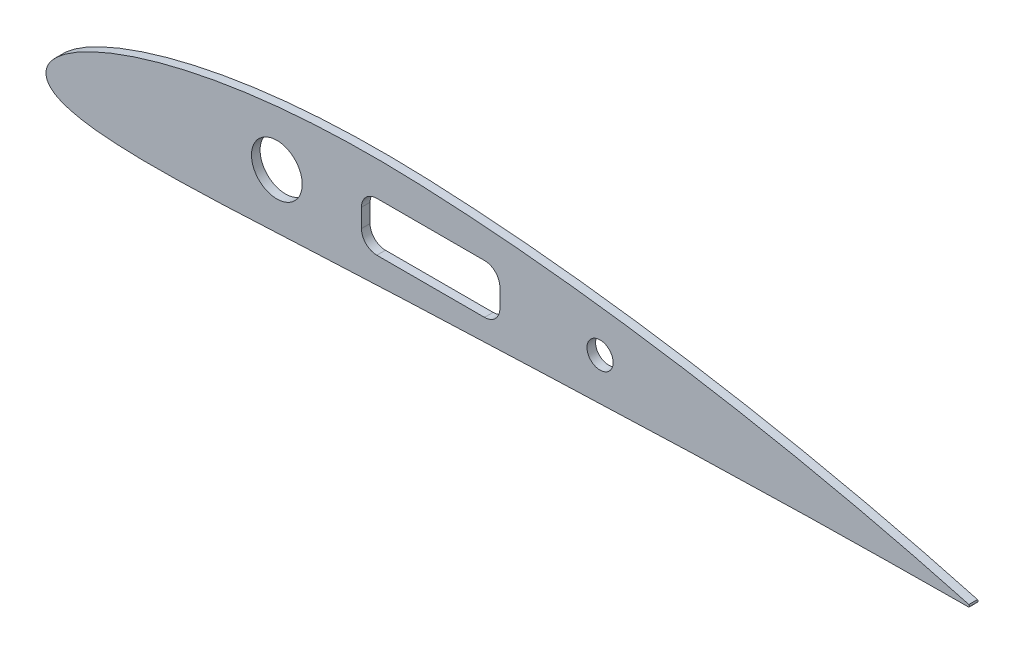
ISO-10303-21;
HEADER;
FILE_DESCRIPTION(('STEP AP214'),'2;1');
FILE_NAME('part.step','',(''),(''),'','','');
FILE_SCHEMA(('AUTOMOTIVE_DESIGN { 1 0 10303 214 1 1 1 1 }'));
ENDSEC;
DATA;
#1=APPLICATION_CONTEXT('core data for automotive mechanical design processes');
#2=APPLICATION_PROTOCOL_DEFINITION('international standard','automotive_design',2000,#1);
#3=PRODUCT_CONTEXT('',#1,'mechanical');
#4=PRODUCT('Part','Part','',(#3));
#5=PRODUCT_RELATED_PRODUCT_CATEGORY('part','',(#4));
#6=PRODUCT_DEFINITION_FORMATION('','',#4);
#7=PRODUCT_DEFINITION_CONTEXT('part definition',#1,'design');
#8=PRODUCT_DEFINITION('design','',#6,#7);
#9=PRODUCT_DEFINITION_SHAPE('','',#8);
#10=(LENGTH_UNIT() NAMED_UNIT(*) SI_UNIT(.MILLI.,.METRE.));
#11=(NAMED_UNIT(*) PLANE_ANGLE_UNIT() SI_UNIT($,.RADIAN.));
#12=(NAMED_UNIT(*) SI_UNIT($,.STERADIAN.) SOLID_ANGLE_UNIT());
#13=UNCERTAINTY_MEASURE_WITH_UNIT(LENGTH_MEASURE(1.E-05),#10,'distance_accuracy_value','');
#14=(GEOMETRIC_REPRESENTATION_CONTEXT(3) GLOBAL_UNCERTAINTY_ASSIGNED_CONTEXT((#13)) GLOBAL_UNIT_ASSIGNED_CONTEXT((#10,
#11,#12)) REPRESENTATION_CONTEXT('',''));
#15=CARTESIAN_POINT('',(0.,0.,0.));
#16=DIRECTION('',(0.,0.,1.));
#17=DIRECTION('',(1.,0.,0.));
#18=AXIS2_PLACEMENT_3D('',#15,#16,#17);
#19=CARTESIAN_POINT('',(148.430746079089,-4.2796086798326,1.4));
#20=DIRECTION('',(0.,0.,-1.));
#21=DIRECTION('',(-1.,0.,0.));
#22=AXIS2_PLACEMENT_3D('',#19,#20,#21);
#23=PLANE('',#22);
#24=CARTESIAN_POINT('',(180.094939635946,10.6624450341782,1.4));
#25=DIRECTION('',(0.,0.,1.));
#26=DIRECTION('',(1.,0.,0.));
#27=AXIS2_PLACEMENT_3D('',#24,#25,#26);
#28=CIRCLE('',#27,4.25000000000001);
#29=CARTESIAN_POINT('',(184.344939635946,10.6624450341782,1.4));
#30=VERTEX_POINT('',#29);
#31=EDGE_CURVE('E194',#30,#30,#28,.T.);
#32=ORIENTED_EDGE('',*,*,#31,.F.);
#33=EDGE_LOOP('',(#32));
#34=FACE_BOUND('',#33,.T.);
#35=CARTESIAN_POINT('',(75.0410106816443,10.3155765877524,1.4));
#36=DIRECTION('',(0.,0.,1.));
#37=DIRECTION('',(1.,0.,0.));
#38=AXIS2_PLACEMENT_3D('',#35,#36,#37);
#39=CIRCLE('',#38,8.25000000000637);
#40=CARTESIAN_POINT('',(83.2910106816506,10.3155765877524,1.4));
#41=VERTEX_POINT('',#40);
#42=EDGE_CURVE('E200',#41,#41,#39,.T.);
#43=ORIENTED_EDGE('',*,*,#42,.F.);
#44=EDGE_LOOP('',(#43));
#45=FACE_BOUND('',#44,.T.);
#46=CARTESIAN_POINT('',(0.00249,-0.14724,1.4));
#47=CARTESIAN_POINT('',(0.0288641688854633,-0.445513844414603,1.4));
#48=CARTESIAN_POINT('',(0.0833057800904263,-1.06121129978275,1.4));
#49=CARTESIAN_POINT('',(0.422671390377827,-1.96663822729653,1.4));
#50=CARTESIAN_POINT('',(0.976281814573221,-2.83807289649458,1.4));
#51=CARTESIAN_POINT('',(1.75645978779488,-3.64713332484532,1.4));
#52=CARTESIAN_POINT('',(2.74907794082149,-4.3931984024834,1.4));
#53=CARTESIAN_POINT('',(3.96714374613249,-5.08293585867439,1.4));
#54=CARTESIAN_POINT('',(5.44229690863356,-5.72840886692502,1.4));
#55=CARTESIAN_POINT('',(7.2356982456091,-6.33863063415687,1.4));
#56=CARTESIAN_POINT('',(9.44277622720337,-6.91837999855022,1.4));
#57=CARTESIAN_POINT('',(12.2025981281143,-7.46605991636749,1.4));
#58=CARTESIAN_POINT('',(15.6905256540105,-7.96754247553604,1.4));
#59=CARTESIAN_POINT('',(20.0737384988992,-8.3915480858464,1.4));
#60=CARTESIAN_POINT('',(25.4279424931762,-8.69681417335037,1.4));
#61=CARTESIAN_POINT('',(31.6799813058299,-8.85196661878203,1.4));
#62=CARTESIAN_POINT('',(38.6368782746042,-8.85150829562618,1.4));
#63=CARTESIAN_POINT('',(46.0773681114888,-8.71372389572811,1.4));
#64=CARTESIAN_POINT('',(53.8291461214035,-8.46796962975638,1.4));
#65=CARTESIAN_POINT('',(61.7838517154262,-8.14374423824506,1.4));
#66=CARTESIAN_POINT('',(69.8771771185494,-7.76678950417677,1.4));
#67=CARTESIAN_POINT('',(78.0625135272191,-7.3594227174564,1.4));
#68=CARTESIAN_POINT('',(86.2929272510796,-6.94080621211282,1.4));
#69=CARTESIAN_POINT('',(94.52565069144,-6.52761654439103,1.4));
#70=CARTESIAN_POINT('',(102.732598331766,-6.1331415031146,1.4));
#71=CARTESIAN_POINT('',(110.918529107916,-5.76594399090627,1.4));
#72=CARTESIAN_POINT('',(119.106037428137,-5.43837798583262,1.4));
#73=CARTESIAN_POINT('',(127.316854085887,-5.13392960517217,1.4));
#74=CARTESIAN_POINT('',(135.563054016299,-4.80370791115035,1.4));
#75=CARTESIAN_POINT('',(143.837285105454,-4.46781142112651,1.4));
#76=CARTESIAN_POINT('',(152.128632568186,-4.12808075570405,1.4));
#77=CARTESIAN_POINT('',(160.417875855798,-3.79043472053915,1.4));
#78=CARTESIAN_POINT('',(168.698244488521,-3.4588568645267,1.4));
#79=CARTESIAN_POINT('',(176.966416513952,-3.1367075499438,1.4));
#80=CARTESIAN_POINT('',(185.223122892775,-2.82675169781747,1.4));
#81=CARTESIAN_POINT('',(193.47005296097,-2.53124390528859,1.4));
#82=CARTESIAN_POINT('',(201.709043695345,-2.25196088915263,1.4));
#83=CARTESIAN_POINT('',(209.941894226343,-1.99037172481699,1.4));
#84=CARTESIAN_POINT('',(218.170315158738,-1.74765374764245,1.4));
#85=CARTESIAN_POINT('',(226.395881354852,-1.52446005264915,1.4));
#86=CARTESIAN_POINT('',(234.619974201183,-1.32133546096737,1.4));
#87=CARTESIAN_POINT('',(242.843439472485,-1.13834062649556,1.4));
#88=CARTESIAN_POINT('',(253.799028348439,-0.921290824137908,1.4));
#89=CARTESIAN_POINT('',(264.723718399079,-0.743927690678651,1.4));
#90=CARTESIAN_POINT('',(275.541156206627,-0.603511415990534,1.4));
#91=CARTESIAN_POINT('',(283.304824624749,-0.517817030046947,1.4));
#92=CARTESIAN_POINT('',(290.376932295173,-0.451824553738442,1.4));
#93=CARTESIAN_POINT('',(295.870764012939,-0.407443063098533,1.4));
#94=CARTESIAN_POINT('',(298.944589157433,-0.385525490945527,1.4));
#95=CARTESIAN_POINT('',(300.,-0.378,1.4));
#96=B_SPLINE_CURVE_WITH_KNOTS('',3,(#46,#47,#48,#49,#50,#51,#52,#53,#54,#55,#56,#57,#58,#59,#60,
#61,#62,#63,#64,#65,#66,#67,#68,#69,#70,#71,#72,#73,#74,#75,#76,#77,#78,#79,#80,#81,#82,#83,#84,
#85,#86,#87,#88,#89,#90,#91,#92,#93,#94,#95),.UNSPECIFIED.,.F.,.F.,(4,1,1,1,1,1,1,1,1,1,1,1,1,1,
1,1,1,1,1,1,1,1,1,1,1,1,1,1,1,1,1,1,1,1,1,1,1,1,1,1,1,1,1,1,1,1,1,4),(0.,0.00295155454187813,
0.00609260468138345,0.00945089974770261,0.0131050353483775,0.0171458323785718,
0.0216960994114763,0.0269215768167943,0.0330527867072691,0.0404178803055317,0.049480061989254,
0.0608721953266465,0.0752631118751332,0.0930303587905709,0.113913710781101,0.137122622864392,
0.161846787507909,0.187529050722836,0.213844767657257,0.240604039549654,0.267679501362261,
0.294919063837578,0.322129351782385,0.34922488677745,0.37620063639372,0.40319053291318,
0.430285050730301,0.457482608831412,0.484832061499181,0.512206010416882,0.53957427714013,
0.566902093806344,0.594185888539568,0.621429901327116,0.648639753003801,0.675821648028279,
0.70298156459292,0.730124951930402,0.757257323678464,0.784383538796943,0.811507209416005,
0.838628701004968,0.892783780904612,0.919594556327485,0.945650049930795,0.969591154880402,
0.989558994627054,1.),.UNSPECIFIED.);
#97=CARTESIAN_POINT('',(0.00249,-0.14724,1.4));
#98=VERTEX_POINT('',#97);
#99=CARTESIAN_POINT('',(300.,-0.378,1.4));
#100=VERTEX_POINT('',#99);
#101=EDGE_CURVE('E205',#98,#100,#96,.T.);
#102=ORIENTED_EDGE('',*,*,#101,.T.);
#103=CARTESIAN_POINT('',(299.622,0.,1.4));
#104=DIRECTION('',(0.,0.,1.));
#105=DIRECTION('',(-1.,0.,0.));
#106=AXIS2_PLACEMENT_3D('',#103,#104,#105);
#107=CIRCLE('',#106,0.534572726577062);
#108=CARTESIAN_POINT('',(300.,0.378,1.4));
#109=VERTEX_POINT('',#108);
#110=EDGE_CURVE('E211',#100,#109,#107,.T.);
#111=ORIENTED_EDGE('',*,*,#110,.T.);
#112=CARTESIAN_POINT('',(300.,0.378,1.4));
#113=CARTESIAN_POINT('',(298.98680128776,0.654023781403535,1.4));
#114=CARTESIAN_POINT('',(296.064210837156,1.45021949101575,1.4));
#115=CARTESIAN_POINT('',(290.869598499995,2.83000686313952,1.4));
#116=CARTESIAN_POINT('',(284.21971344516,4.54515043735707,1.4));
#117=CARTESIAN_POINT('',(276.935901935239,6.35761060470515,1.4));
#118=CARTESIAN_POINT('',(269.347101536954,8.17543923315356,1.4));
#119=CARTESIAN_POINT('',(261.636652194795,9.9499327589503,1.4));
#120=CARTESIAN_POINT('',(253.874886053528,11.663682067936,1.4));
#121=CARTESIAN_POINT('',(246.086893810767,13.310849918933,1.4));
#122=CARTESIAN_POINT('',(238.28156509519,14.8894208716766,1.4));
#123=CARTESIAN_POINT('',(230.462843896224,16.3983575086196,1.4));
#124=CARTESIAN_POINT('',(222.633143967381,17.8369119637227,1.4));
#125=CARTESIAN_POINT('',(214.794406789338,19.2040857344674,1.4));
#126=CARTESIAN_POINT('',(206.948477689533,20.498865738249,1.4));
#127=CARTESIAN_POINT('',(199.097180513816,21.7197934093402,1.4));
#128=CARTESIAN_POINT('',(191.242416874809,22.8654021777622,1.4));
#129=CARTESIAN_POINT('',(183.386166153563,23.9338627233875,1.4));
#130=CARTESIAN_POINT('',(175.530527281634,24.923138619396,1.4));
#131=CARTESIAN_POINT('',(167.677631749552,25.8308113359842,1.4));
#132=CARTESIAN_POINT('',(159.83020407637,26.6544050986667,1.4));
#133=CARTESIAN_POINT('',(151.990419631337,27.3908657144166,1.4));
#134=CARTESIAN_POINT('',(144.164125101971,28.0367679193056,1.4));
#135=CARTESIAN_POINT('',(136.354280568601,28.5896127888858,1.4));
#136=CARTESIAN_POINT('',(128.583278444944,29.0402911124387,1.4));
#137=CARTESIAN_POINT('',(120.889314831539,29.3980794120577,1.4));
#138=CARTESIAN_POINT('',(113.294103257856,29.623979722126,1.4));
#139=CARTESIAN_POINT('',(105.787101591505,29.6881147803117,1.4));
#140=CARTESIAN_POINT('',(98.338851666315,29.5906189722756,1.4));
#141=CARTESIAN_POINT('',(90.9366247098875,29.3292165699766,1.4));
#142=CARTESIAN_POINT('',(83.5844315304011,28.8982617847225,1.4));
#143=CARTESIAN_POINT('',(76.290492602127,28.2936076331489,1.4));
#144=CARTESIAN_POINT('',(69.0662274611627,27.5099359897076,1.4));
#145=CARTESIAN_POINT('',(61.9269152260386,26.5428786259249,1.4));
#146=CARTESIAN_POINT('',(54.8932803737344,25.387877318499,1.4));
#147=CARTESIAN_POINT('',(47.9950291130081,24.0424456674072,1.4));
#148=CARTESIAN_POINT('',(41.2775038108488,22.5075794810016,1.4));
#149=CARTESIAN_POINT('',(34.8124585242293,20.7931387290732,1.4));
#150=CARTESIAN_POINT('',(28.7109580899014,18.9262379057851,1.4));
#151=CARTESIAN_POINT('',(23.1248146078509,16.961123320747,1.4));
#152=CARTESIAN_POINT('',(18.2149180695505,14.9800025250558,1.4));
#153=CARTESIAN_POINT('',(14.0885709481161,13.0747331937673,1.4));
#154=CARTESIAN_POINT('',(10.7512462427716,11.315492838388,1.4));
#155=CARTESIAN_POINT('',(8.11306941612396,9.73032383929158,1.4));
#156=CARTESIAN_POINT('',(6.04045169768157,8.3095656657077,1.4));
#157=CARTESIAN_POINT('',(4.40603392011968,7.02507559718571,1.4));
#158=CARTESIAN_POINT('',(3.11052134783298,5.84556644236323,1.4));
#159=CARTESIAN_POINT('',(2.08581080220328,4.74311489195384,1.4));
#160=CARTESIAN_POINT('',(1.28384499577925,3.69713564801613,1.4));
#161=CARTESIAN_POINT('',(0.685974492458288,2.68994652273,1.4));
#162=CARTESIAN_POINT('',(0.258928678594649,1.71694247641125,1.4));
#163=CARTESIAN_POINT('',(0.122706697861263,1.0598900334139,1.4));
#164=CARTESIAN_POINT('',(0.05757,0.74571,1.4));
#165=B_SPLINE_CURVE_WITH_KNOTS('',3,(#112,#113,#114,#115,#116,#117,#118,#119,#120,#121,#122,
#123,#124,#125,#126,#127,#128,#129,#130,#131,#132,#133,#134,#135,#136,#137,#138,#139,#140,#141,
#142,#143,#144,#145,#146,#147,#148,#149,#150,#151,#152,#153,#154,#155,#156,#157,#158,#159,#160,
#161,#162,#163,#164),.UNSPECIFIED.,.F.,.F.,(4,1,1,1,1,1,1,1,1,1,1,1,1,1,1,1,1,1,1,1,1,1,1,1,1,1,
1,1,1,1,1,1,1,1,1,1,1,1,1,1,1,1,1,1,1,1,1,1,1,1,4),(0.,0.0101621996718152,0.029313053164405,
0.0520116049167947,0.0766194676467142,0.101948061207292,0.127526131749972,0.153184130655642,
0.178867887696566,0.204557902716051,0.230245711588722,0.255925967287604,0.281594302232909,
0.307246419826604,0.332878041533464,0.358484538095463,0.384061185999046,0.409602822472883,
0.435103874040523,0.460559416336008,0.485959195382529,0.511303069995141,0.53655151535457,
0.561723365940153,0.586628866723787,0.611085431247163,0.63525120042125,0.659272175841394,
0.683163753229342,0.706922144180534,0.730535909866309,0.753983199646257,0.777234690063445,
0.800246382303428,0.822950708941546,0.845237155368769,0.866915895838024,0.887662334604257,
0.906968280539555,0.924203157053238,0.938878974509372,0.95093161065299,0.960693484285195,
0.968646729467272,0.975232933115936,0.980794743901537,0.985583761312909,0.989781538836832,
0.99352131251264,0.996902112954681,1.),.UNSPECIFIED.);
#166=CARTESIAN_POINT('',(0.05757,0.74571,1.4));
#167=VERTEX_POINT('',#166);
#168=EDGE_CURVE('E217',#109,#167,#165,.T.);
#169=ORIENTED_EDGE('',*,*,#168,.T.);
#170=DIRECTION('',(-0.0769725523661737,-0.997033212176123,0.));
#171=VECTOR('',#170,1.);
#172=CARTESIAN_POINT('',(0.05757,0.74571,1.4));
#173=LINE('',#172,#171);
#174=CARTESIAN_POINT('',(0.,0.,1.4));
#175=VERTEX_POINT('',#174);
#176=EDGE_CURVE('E222',#167,#175,#173,.T.);
#177=ORIENTED_EDGE('',*,*,#176,.T.);
#178=DIRECTION('',(0.0169087477716238,-0.999857036905175,0.));
#179=VECTOR('',#178,1.);
#180=CARTESIAN_POINT('',(0.,0.,1.4));
#181=LINE('',#180,#179);
#182=EDGE_CURVE('E281',#175,#98,#181,.T.);
#183=ORIENTED_EDGE('',*,*,#182,.T.);
#184=EDGE_LOOP('',(#102,#111,#169,#177,#183));
#185=FACE_BOUND('',#184,.T.);
#186=CARTESIAN_POINT('',(142.541010681644,13.4806672463687,1.4));
#187=DIRECTION('',(0.,0.,1.));
#188=DIRECTION('',(-1.,0.,0.));
#189=AXIS2_PLACEMENT_3D('',#186,#187,#188);
#190=CIRCLE('',#189,5.);
#191=CARTESIAN_POINT('',(147.541010681644,13.4806672463687,1.4));
#192=VERTEX_POINT('',#191);
#193=CARTESIAN_POINT('',(142.541010681644,18.4806672463687,1.4));
#194=VERTEX_POINT('',#193);
#195=EDGE_CURVE('E129',#192,#194,#190,.T.);
#196=ORIENTED_EDGE('',*,*,#195,.F.);
#197=DIRECTION('',(0.,1.,0.));
#198=VECTOR('',#197,1.);
#199=CARTESIAN_POINT('',(147.541010681644,7.48066724636866,1.4));
#200=LINE('',#199,#198);
#201=CARTESIAN_POINT('',(147.541010681644,7.48066724636866,1.4));
#202=VERTEX_POINT('',#201);
#203=EDGE_CURVE('E162',#202,#192,#200,.T.);
#204=ORIENTED_EDGE('',*,*,#203,.F.);
#205=CARTESIAN_POINT('',(142.541010681644,7.48066724636866,1.4));
#206=DIRECTION('',(0.,0.,1.));
#207=DIRECTION('',(1.,0.,0.));
#208=AXIS2_PLACEMENT_3D('',#205,#206,#207);
#209=CIRCLE('',#208,5.);
#210=CARTESIAN_POINT('',(142.541010681644,2.48066724636866,1.4));
#211=VERTEX_POINT('',#210);
#212=EDGE_CURVE('E160',#211,#202,#209,.T.);
#213=ORIENTED_EDGE('',*,*,#212,.F.);
#214=DIRECTION('',(1.,0.,0.));
#215=VECTOR('',#214,1.);
#216=CARTESIAN_POINT('',(107.541010681644,2.48066724636866,1.4));
#217=LINE('',#216,#215);
#218=CARTESIAN_POINT('',(107.541010681644,2.48066724636865,1.4));
#219=VERTEX_POINT('',#218);
#220=EDGE_CURVE('E158',#219,#211,#217,.T.);
#221=ORIENTED_EDGE('',*,*,#220,.F.);
#222=CARTESIAN_POINT('',(107.541010681644,7.48066724636866,1.4));
#223=DIRECTION('',(0.,0.,1.));
#224=DIRECTION('',(-1.,0.,0.));
#225=AXIS2_PLACEMENT_3D('',#222,#223,#224);
#226=CIRCLE('',#225,5.);
#227=CARTESIAN_POINT('',(102.541010681644,7.48066724636866,1.4));
#228=VERTEX_POINT('',#227);
#229=EDGE_CURVE('E156',#228,#219,#226,.T.);
#230=ORIENTED_EDGE('',*,*,#229,.F.);
#231=DIRECTION('',(0.,-1.,0.));
#232=VECTOR('',#231,1.);
#233=CARTESIAN_POINT('',(102.541010681644,7.48066724636866,1.4));
#234=LINE('',#233,#232);
#235=CARTESIAN_POINT('',(102.541010681644,13.4806672463687,1.4));
#236=VERTEX_POINT('',#235);
#237=EDGE_CURVE('E152',#236,#228,#234,.T.);
#238=ORIENTED_EDGE('',*,*,#237,.F.);
#239=CARTESIAN_POINT('',(107.541010681644,13.4806672463687,1.4));
#240=DIRECTION('',(0.,0.,1.));
#241=DIRECTION('',(-1.,0.,0.));
#242=AXIS2_PLACEMENT_3D('',#239,#240,#241);
#243=CIRCLE('',#242,5.);
#244=CARTESIAN_POINT('',(107.541010681644,18.4806672463687,1.4));
#245=VERTEX_POINT('',#244);
#246=EDGE_CURVE('E150',#245,#236,#243,.T.);
#247=ORIENTED_EDGE('',*,*,#246,.F.);
#248=DIRECTION('',(-1.,0.,0.));
#249=VECTOR('',#248,1.);
#250=CARTESIAN_POINT('',(107.541010681644,18.4806672463687,1.4));
#251=LINE('',#250,#249);
#252=EDGE_CURVE('E137',#194,#245,#251,.T.);
#253=ORIENTED_EDGE('',*,*,#252,.F.);
#254=EDGE_LOOP('',(#196,#204,#213,#221,#230,#238,#247,#253));
#255=FACE_BOUND('',#254,.T.);
#256=ADVANCED_FACE('F33',(#34,#45,#185,#255),#23,.F.);
#257=CARTESIAN_POINT('',(148.430746079089,-4.2796086798326,-1.4));
#258=DIRECTION('',(0.,0.,-1.));
#259=DIRECTION('',(-1.,0.,0.));
#260=AXIS2_PLACEMENT_3D('',#257,#258,#259);
#261=PLANE('',#260);
#262=CARTESIAN_POINT('',(75.0410106816443,10.3155765877524,-1.4));
#263=DIRECTION('',(0.,0.,1.));
#264=DIRECTION('',(1.,0.,0.));
#265=AXIS2_PLACEMENT_3D('',#262,#263,#264);
#266=CIRCLE('',#265,8.25000000000637);
#267=CARTESIAN_POINT('',(83.2910106816506,10.3155765877524,-1.4));
#268=VERTEX_POINT('',#267);
#269=EDGE_CURVE('E197',#268,#268,#266,.T.);
#270=ORIENTED_EDGE('',*,*,#269,.T.);
#271=EDGE_LOOP('',(#270));
#272=FACE_BOUND('',#271,.T.);
#273=CARTESIAN_POINT('',(0.00249,-0.14724,-1.4));
#274=CARTESIAN_POINT('',(0.0288641688854633,-0.445513844414603,-1.4));
#275=CARTESIAN_POINT('',(0.0833057800904263,-1.06121129978275,-1.4));
#276=CARTESIAN_POINT('',(0.422671390377827,-1.96663822729653,-1.4));
#277=CARTESIAN_POINT('',(0.976281814573221,-2.83807289649458,-1.4));
#278=CARTESIAN_POINT('',(1.75645978779488,-3.64713332484532,-1.4));
#279=CARTESIAN_POINT('',(2.74907794082149,-4.3931984024834,-1.4));
#280=CARTESIAN_POINT('',(3.96714374613249,-5.08293585867439,-1.4));
#281=CARTESIAN_POINT('',(5.44229690863356,-5.72840886692502,-1.4));
#282=CARTESIAN_POINT('',(7.2356982456091,-6.33863063415687,-1.4));
#283=CARTESIAN_POINT('',(9.44277622720337,-6.91837999855022,-1.4));
#284=CARTESIAN_POINT('',(12.2025981281143,-7.46605991636749,-1.4));
#285=CARTESIAN_POINT('',(15.6905256540105,-7.96754247553604,-1.4));
#286=CARTESIAN_POINT('',(20.0737384988992,-8.3915480858464,-1.4));
#287=CARTESIAN_POINT('',(25.4279424931762,-8.69681417335037,-1.4));
#288=CARTESIAN_POINT('',(31.6799813058299,-8.85196661878203,-1.4));
#289=CARTESIAN_POINT('',(38.6368782746042,-8.85150829562618,-1.4));
#290=CARTESIAN_POINT('',(46.0773681114888,-8.71372389572811,-1.4));
#291=CARTESIAN_POINT('',(53.8291461214035,-8.46796962975638,-1.4));
#292=CARTESIAN_POINT('',(61.7838517154262,-8.14374423824506,-1.4));
#293=CARTESIAN_POINT('',(69.8771771185494,-7.76678950417677,-1.4));
#294=CARTESIAN_POINT('',(78.0625135272191,-7.3594227174564,-1.4));
#295=CARTESIAN_POINT('',(86.2929272510796,-6.94080621211282,-1.4));
#296=CARTESIAN_POINT('',(94.52565069144,-6.52761654439103,-1.4));
#297=CARTESIAN_POINT('',(102.732598331766,-6.1331415031146,-1.4));
#298=CARTESIAN_POINT('',(110.918529107916,-5.76594399090627,-1.4));
#299=CARTESIAN_POINT('',(119.106037428137,-5.43837798583262,-1.4));
#300=CARTESIAN_POINT('',(127.316854085887,-5.13392960517217,-1.4));
#301=CARTESIAN_POINT('',(135.563054016299,-4.80370791115035,-1.4));
#302=CARTESIAN_POINT('',(143.837285105454,-4.46781142112651,-1.4));
#303=CARTESIAN_POINT('',(152.128632568186,-4.12808075570405,-1.4));
#304=CARTESIAN_POINT('',(160.417875855798,-3.79043472053915,-1.4));
#305=CARTESIAN_POINT('',(168.698244488521,-3.4588568645267,-1.4));
#306=CARTESIAN_POINT('',(176.966416513952,-3.1367075499438,-1.4));
#307=CARTESIAN_POINT('',(185.223122892775,-2.82675169781747,-1.4));
#308=CARTESIAN_POINT('',(193.47005296097,-2.53124390528859,-1.4));
#309=CARTESIAN_POINT('',(201.709043695345,-2.25196088915263,-1.4));
#310=CARTESIAN_POINT('',(209.941894226343,-1.99037172481699,-1.4));
#311=CARTESIAN_POINT('',(218.170315158738,-1.74765374764245,-1.4));
#312=CARTESIAN_POINT('',(226.395881354852,-1.52446005264915,-1.4));
#313=CARTESIAN_POINT('',(234.619974201183,-1.32133546096737,-1.4));
#314=CARTESIAN_POINT('',(242.843439472485,-1.13834062649556,-1.4));
#315=CARTESIAN_POINT('',(253.799028348439,-0.921290824137908,-1.4));
#316=CARTESIAN_POINT('',(264.723718399079,-0.743927690678651,-1.4));
#317=CARTESIAN_POINT('',(275.541156206627,-0.603511415990534,-1.4));
#318=CARTESIAN_POINT('',(283.304824624749,-0.517817030046947,-1.4));
#319=CARTESIAN_POINT('',(290.376932295173,-0.451824553738442,-1.4));
#320=CARTESIAN_POINT('',(295.870764012939,-0.407443063098533,-1.4));
#321=CARTESIAN_POINT('',(298.944589157433,-0.385525490945527,-1.4));
#322=CARTESIAN_POINT('',(300.,-0.378,-1.4));
#323=B_SPLINE_CURVE_WITH_KNOTS('',3,(#273,#274,#275,#276,#277,#278,#279,#280,#281,#282,#283,
#284,#285,#286,#287,#288,#289,#290,#291,#292,#293,#294,#295,#296,#297,#298,#299,#300,#301,#302,
#303,#304,#305,#306,#307,#308,#309,#310,#311,#312,#313,#314,#315,#316,#317,#318,#319,#320,#321,
#322),.UNSPECIFIED.,.F.,.F.,(4,1,1,1,1,1,1,1,1,1,1,1,1,1,1,1,1,1,1,1,1,1,1,1,1,1,1,1,1,1,1,1,1,
1,1,1,1,1,1,1,1,1,1,1,1,1,1,4),(0.,0.00295155454187813,0.00609260468138345,0.00945089974770261,
0.0131050353483775,0.0171458323785718,0.0216960994114763,0.0269215768167943,0.0330527867072691,
0.0404178803055317,0.049480061989254,0.0608721953266465,0.0752631118751332,0.0930303587905709,
0.113913710781101,0.137122622864392,0.161846787507909,0.187529050722836,0.213844767657257,
0.240604039549654,0.267679501362261,0.294919063837578,0.322129351782385,0.34922488677745,
0.37620063639372,0.40319053291318,0.430285050730301,0.457482608831412,0.484832061499181,
0.512206010416882,0.53957427714013,0.566902093806344,0.594185888539568,0.621429901327116,
0.648639753003801,0.675821648028279,0.70298156459292,0.730124951930402,0.757257323678464,
0.784383538796943,0.811507209416005,0.838628701004968,0.892783780904612,0.919594556327485,
0.945650049930795,0.969591154880402,0.989558994627054,1.),.UNSPECIFIED.);
#324=CARTESIAN_POINT('',(0.00249,-0.14724,-1.4));
#325=VERTEX_POINT('',#324);
#326=CARTESIAN_POINT('',(300.,-0.378,-1.4));
#327=VERTEX_POINT('',#326);
#328=EDGE_CURVE('E203',#325,#327,#323,.T.);
#329=ORIENTED_EDGE('',*,*,#328,.F.);
#330=DIRECTION('',(0.0169087477716238,-0.999857036905175,0.));
#331=VECTOR('',#330,1.);
#332=CARTESIAN_POINT('',(0.,0.,-1.4));
#333=LINE('',#332,#331);
#334=CARTESIAN_POINT('',(0.,0.,-1.4));
#335=VERTEX_POINT('',#334);
#336=EDGE_CURVE('E212',#335,#325,#333,.T.);
#337=ORIENTED_EDGE('',*,*,#336,.F.);
#338=DIRECTION('',(-0.0769725523661737,-0.997033212176123,0.));
#339=VECTOR('',#338,1.);
#340=CARTESIAN_POINT('',(0.05757,0.74571,-1.4));
#341=LINE('',#340,#339);
#342=CARTESIAN_POINT('',(0.05757,0.74571,-1.4));
#343=VERTEX_POINT('',#342);
#344=EDGE_CURVE('E277',#343,#335,#341,.T.);
#345=ORIENTED_EDGE('',*,*,#344,.F.);
#346=CARTESIAN_POINT('',(300.,0.378,-1.4));
#347=CARTESIAN_POINT('',(298.98680128776,0.654023781403535,-1.4));
#348=CARTESIAN_POINT('',(296.064210837156,1.45021949101575,-1.4));
#349=CARTESIAN_POINT('',(290.869598499995,2.83000686313952,-1.4));
#350=CARTESIAN_POINT('',(284.21971344516,4.54515043735707,-1.4));
#351=CARTESIAN_POINT('',(276.935901935239,6.35761060470515,-1.4));
#352=CARTESIAN_POINT('',(269.347101536954,8.17543923315356,-1.4));
#353=CARTESIAN_POINT('',(261.636652194795,9.9499327589503,-1.4));
#354=CARTESIAN_POINT('',(253.874886053528,11.663682067936,-1.4));
#355=CARTESIAN_POINT('',(246.086893810767,13.310849918933,-1.4));
#356=CARTESIAN_POINT('',(238.28156509519,14.8894208716766,-1.4));
#357=CARTESIAN_POINT('',(230.462843896224,16.3983575086196,-1.4));
#358=CARTESIAN_POINT('',(222.633143967381,17.8369119637227,-1.4));
#359=CARTESIAN_POINT('',(214.794406789338,19.2040857344674,-1.4));
#360=CARTESIAN_POINT('',(206.948477689533,20.498865738249,-1.4));
#361=CARTESIAN_POINT('',(199.097180513816,21.7197934093402,-1.4));
#362=CARTESIAN_POINT('',(191.242416874809,22.8654021777622,-1.4));
#363=CARTESIAN_POINT('',(183.386166153563,23.9338627233875,-1.4));
#364=CARTESIAN_POINT('',(175.530527281634,24.923138619396,-1.4));
#365=CARTESIAN_POINT('',(167.677631749552,25.8308113359842,-1.4));
#366=CARTESIAN_POINT('',(159.83020407637,26.6544050986667,-1.4));
#367=CARTESIAN_POINT('',(151.990419631337,27.3908657144166,-1.4));
#368=CARTESIAN_POINT('',(144.164125101971,28.0367679193056,-1.4));
#369=CARTESIAN_POINT('',(136.354280568601,28.5896127888858,-1.4));
#370=CARTESIAN_POINT('',(128.583278444944,29.0402911124387,-1.4));
#371=CARTESIAN_POINT('',(120.889314831539,29.3980794120577,-1.4));
#372=CARTESIAN_POINT('',(113.294103257856,29.623979722126,-1.4));
#373=CARTESIAN_POINT('',(105.787101591505,29.6881147803117,-1.4));
#374=CARTESIAN_POINT('',(98.338851666315,29.5906189722756,-1.4));
#375=CARTESIAN_POINT('',(90.9366247098875,29.3292165699766,-1.4));
#376=CARTESIAN_POINT('',(83.5844315304011,28.8982617847225,-1.4));
#377=CARTESIAN_POINT('',(76.290492602127,28.2936076331489,-1.4));
#378=CARTESIAN_POINT('',(69.0662274611627,27.5099359897076,-1.4));
#379=CARTESIAN_POINT('',(61.9269152260386,26.5428786259249,-1.4));
#380=CARTESIAN_POINT('',(54.8932803737344,25.387877318499,-1.4));
#381=CARTESIAN_POINT('',(47.9950291130081,24.0424456674072,-1.4));
#382=CARTESIAN_POINT('',(41.2775038108488,22.5075794810016,-1.4));
#383=CARTESIAN_POINT('',(34.8124585242293,20.7931387290732,-1.4));
#384=CARTESIAN_POINT('',(28.7109580899014,18.9262379057851,-1.4));
#385=CARTESIAN_POINT('',(23.1248146078509,16.961123320747,-1.4));
#386=CARTESIAN_POINT('',(18.2149180695505,14.9800025250558,-1.4));
#387=CARTESIAN_POINT('',(14.0885709481161,13.0747331937673,-1.4));
#388=CARTESIAN_POINT('',(10.7512462427716,11.315492838388,-1.4));
#389=CARTESIAN_POINT('',(8.11306941612396,9.73032383929158,-1.4));
#390=CARTESIAN_POINT('',(6.04045169768157,8.3095656657077,-1.4));
#391=CARTESIAN_POINT('',(4.40603392011968,7.02507559718571,-1.4));
#392=CARTESIAN_POINT('',(3.11052134783298,5.84556644236323,-1.4));
#393=CARTESIAN_POINT('',(2.08581080220328,4.74311489195384,-1.4));
#394=CARTESIAN_POINT('',(1.28384499577925,3.69713564801613,-1.4));
#395=CARTESIAN_POINT('',(0.685974492458288,2.68994652273,-1.4));
#396=CARTESIAN_POINT('',(0.258928678594649,1.71694247641125,-1.4));
#397=CARTESIAN_POINT('',(0.122706697861263,1.0598900334139,-1.4));
#398=CARTESIAN_POINT('',(0.05757,0.74571,-1.4));
#399=B_SPLINE_CURVE_WITH_KNOTS('',3,(#346,#347,#348,#349,#350,#351,#352,#353,#354,#355,#356,
#357,#358,#359,#360,#361,#362,#363,#364,#365,#366,#367,#368,#369,#370,#371,#372,#373,#374,#375,
#376,#377,#378,#379,#380,#381,#382,#383,#384,#385,#386,#387,#388,#389,#390,#391,#392,#393,#394,
#395,#396,#397,#398),.UNSPECIFIED.,.F.,.F.,(4,1,1,1,1,1,1,1,1,1,1,1,1,1,1,1,1,1,1,1,1,1,1,1,1,1,
1,1,1,1,1,1,1,1,1,1,1,1,1,1,1,1,1,1,1,1,1,1,1,1,4),(0.,0.0101621996718152,0.029313053164405,
0.0520116049167947,0.0766194676467142,0.101948061207292,0.127526131749972,0.153184130655642,
0.178867887696566,0.204557902716051,0.230245711588722,0.255925967287604,0.281594302232909,
0.307246419826604,0.332878041533464,0.358484538095463,0.384061185999046,0.409602822472883,
0.435103874040523,0.460559416336008,0.485959195382529,0.511303069995141,0.53655151535457,
0.561723365940153,0.586628866723787,0.611085431247163,0.63525120042125,0.659272175841394,
0.683163753229342,0.706922144180534,0.730535909866309,0.753983199646257,0.777234690063445,
0.800246382303428,0.822950708941546,0.845237155368769,0.866915895838024,0.887662334604257,
0.906968280539555,0.924203157053238,0.938878974509372,0.95093161065299,0.960693484285195,
0.968646729467272,0.975232933115936,0.980794743901537,0.985583761312909,0.989781538836832,
0.99352131251264,0.996902112954681,1.),.UNSPECIFIED.);
#400=CARTESIAN_POINT('',(300.,0.378,-1.4));
#401=VERTEX_POINT('',#400);
#402=EDGE_CURVE('E287',#401,#343,#399,.T.);
#403=ORIENTED_EDGE('',*,*,#402,.F.);
#404=CARTESIAN_POINT('',(299.622,0.,-1.4));
#405=DIRECTION('',(0.,0.,1.));
#406=DIRECTION('',(-1.,0.,0.));
#407=AXIS2_PLACEMENT_3D('',#404,#405,#406);
#408=CIRCLE('',#407,0.534572726577062);
#409=EDGE_CURVE('E285',#327,#401,#408,.T.);
#410=ORIENTED_EDGE('',*,*,#409,.F.);
#411=EDGE_LOOP('',(#329,#337,#345,#403,#410));
#412=FACE_BOUND('',#411,.T.);
#413=CARTESIAN_POINT('',(180.094939635946,10.6624450341782,-1.4));
#414=DIRECTION('',(0.,0.,1.));
#415=DIRECTION('',(1.,0.,0.));
#416=AXIS2_PLACEMENT_3D('',#413,#414,#415);
#417=CIRCLE('',#416,4.25000000000001);
#418=CARTESIAN_POINT('',(184.344939635946,10.6624450341782,-1.4));
#419=VERTEX_POINT('',#418);
#420=EDGE_CURVE('E145',#419,#419,#417,.T.);
#421=ORIENTED_EDGE('',*,*,#420,.T.);
#422=EDGE_LOOP('',(#421));
#423=FACE_BOUND('',#422,.T.);
#424=DIRECTION('',(0.,1.,0.));
#425=VECTOR('',#424,1.);
#426=CARTESIAN_POINT('',(147.541010681644,7.48066724636866,-1.4));
#427=LINE('',#426,#425);
#428=CARTESIAN_POINT('',(147.541010681644,7.48066724636866,-1.4));
#429=VERTEX_POINT('',#428);
#430=CARTESIAN_POINT('',(147.541010681644,13.4806672463687,-1.4));
#431=VERTEX_POINT('',#430);
#432=EDGE_CURVE('E138',#429,#431,#427,.T.);
#433=ORIENTED_EDGE('',*,*,#432,.T.);
#434=CARTESIAN_POINT('',(142.541010681644,13.4806672463687,-1.4));
#435=DIRECTION('',(0.,0.,1.));
#436=DIRECTION('',(-1.,0.,0.));
#437=AXIS2_PLACEMENT_3D('',#434,#435,#436);
#438=CIRCLE('',#437,5.);
#439=CARTESIAN_POINT('',(142.541010681644,18.4806672463687,-1.4));
#440=VERTEX_POINT('',#439);
#441=EDGE_CURVE('E57',#431,#440,#438,.T.);
#442=ORIENTED_EDGE('',*,*,#441,.T.);
#443=DIRECTION('',(-1.,0.,0.));
#444=VECTOR('',#443,1.);
#445=CARTESIAN_POINT('',(107.541010681644,18.4806672463687,-1.4));
#446=LINE('',#445,#444);
#447=CARTESIAN_POINT('',(107.541010681644,18.4806672463687,-1.4));
#448=VERTEX_POINT('',#447);
#449=EDGE_CURVE('E144',#440,#448,#446,.T.);
#450=ORIENTED_EDGE('',*,*,#449,.T.);
#451=CARTESIAN_POINT('',(107.541010681644,13.4806672463687,-1.4));
#452=DIRECTION('',(0.,0.,1.));
#453=DIRECTION('',(-1.,0.,0.));
#454=AXIS2_PLACEMENT_3D('',#451,#452,#453);
#455=CIRCLE('',#454,5.);
#456=CARTESIAN_POINT('',(102.541010681644,13.4806672463687,-1.4));
#457=VERTEX_POINT('',#456);
#458=EDGE_CURVE('E166',#448,#457,#455,.T.);
#459=ORIENTED_EDGE('',*,*,#458,.T.);
#460=DIRECTION('',(0.,-1.,0.));
#461=VECTOR('',#460,1.);
#462=CARTESIAN_POINT('',(102.541010681644,7.48066724636866,-1.4));
#463=LINE('',#462,#461);
#464=CARTESIAN_POINT('',(102.541010681644,7.48066724636866,-1.4));
#465=VERTEX_POINT('',#464);
#466=EDGE_CURVE('E169',#457,#465,#463,.T.);
#467=ORIENTED_EDGE('',*,*,#466,.T.);
#468=CARTESIAN_POINT('',(107.541010681644,7.48066724636866,-1.4));
#469=DIRECTION('',(0.,0.,1.));
#470=DIRECTION('',(-1.,0.,0.));
#471=AXIS2_PLACEMENT_3D('',#468,#469,#470);
#472=CIRCLE('',#471,5.);
#473=CARTESIAN_POINT('',(107.541010681644,2.48066724636865,-1.4));
#474=VERTEX_POINT('',#473);
#475=EDGE_CURVE('E172',#465,#474,#472,.T.);
#476=ORIENTED_EDGE('',*,*,#475,.T.);
#477=DIRECTION('',(1.,0.,0.));
#478=VECTOR('',#477,1.);
#479=CARTESIAN_POINT('',(107.541010681644,2.48066724636866,-1.4));
#480=LINE('',#479,#478);
#481=CARTESIAN_POINT('',(142.541010681644,2.48066724636866,-1.4));
#482=VERTEX_POINT('',#481);
#483=EDGE_CURVE('E175',#474,#482,#480,.T.);
#484=ORIENTED_EDGE('',*,*,#483,.T.);
#485=CARTESIAN_POINT('',(142.541010681644,7.48066724636866,-1.4));
#486=DIRECTION('',(0.,0.,1.));
#487=DIRECTION('',(1.,0.,0.));
#488=AXIS2_PLACEMENT_3D('',#485,#486,#487);
#489=CIRCLE('',#488,5.);
#490=EDGE_CURVE('E178',#482,#429,#489,.T.);
#491=ORIENTED_EDGE('',*,*,#490,.T.);
#492=EDGE_LOOP('',(#433,#442,#450,#459,#467,#476,#484,#491));
#493=FACE_BOUND('',#492,.T.);
#494=ADVANCED_FACE('F240',(#272,#412,#423,#493),#261,.T.);
#495=DIRECTION('',(0.,0.,-1.));
#496=VECTOR('',#495,1.);
#497=SURFACE_OF_LINEAR_EXTRUSION('',#96,#496);
#498=ORIENTED_EDGE('',*,*,#328,.T.);
#499=DIRECTION('',(0.,0.,-1.));
#500=VECTOR('',#499,1.);
#501=CARTESIAN_POINT('',(300.,-0.378,1.4));
#502=LINE('',#501,#500);
#503=EDGE_CURVE('E11',#100,#327,#502,.T.);
#504=ORIENTED_EDGE('',*,*,#503,.F.);
#505=ORIENTED_EDGE('',*,*,#101,.F.);
#506=DIRECTION('',(0.,0.,-1.));
#507=VECTOR('',#506,1.);
#508=CARTESIAN_POINT('',(0.00249,-0.14724,1.4));
#509=LINE('',#508,#507);
#510=EDGE_CURVE('E270',#98,#325,#509,.T.);
#511=ORIENTED_EDGE('',*,*,#510,.T.);
#512=EDGE_LOOP('',(#498,#504,#505,#511));
#513=FACE_BOUND('',#512,.T.);
#514=ADVANCED_FACE('F35',(#513),#497,.F.);
#515=CARTESIAN_POINT('',(299.622,0.,1.4));
#516=DIRECTION('',(0.,0.,-1.));
#517=DIRECTION('',(-1.,0.,0.));
#518=AXIS2_PLACEMENT_3D('',#515,#516,#517);
#519=CYLINDRICAL_SURFACE('',#518,0.534572726577062);
#520=ORIENTED_EDGE('',*,*,#409,.T.);
#521=DIRECTION('',(0.,0.,-1.));
#522=VECTOR('',#521,1.);
#523=CARTESIAN_POINT('',(300.,0.378,1.4));
#524=LINE('',#523,#522);
#525=EDGE_CURVE('E42',#109,#401,#524,.T.);
#526=ORIENTED_EDGE('',*,*,#525,.F.);
#527=ORIENTED_EDGE('',*,*,#110,.F.);
#528=ORIENTED_EDGE('',*,*,#503,.T.);
#529=EDGE_LOOP('',(#520,#526,#527,#528));
#530=FACE_BOUND('',#529,.T.);
#531=ADVANCED_FACE('F232',(#530),#519,.T.);
#532=DIRECTION('',(0.,0.,-1.));
#533=VECTOR('',#532,1.);
#534=SURFACE_OF_LINEAR_EXTRUSION('',#165,#533);
#535=ORIENTED_EDGE('',*,*,#402,.T.);
#536=DIRECTION('',(0.,0.,-1.));
#537=VECTOR('',#536,1.);
#538=CARTESIAN_POINT('',(0.05757,0.74571,1.4));
#539=LINE('',#538,#537);
#540=EDGE_CURVE('E303',#167,#343,#539,.T.);
#541=ORIENTED_EDGE('',*,*,#540,.F.);
#542=ORIENTED_EDGE('',*,*,#168,.F.);
#543=ORIENTED_EDGE('',*,*,#525,.T.);
#544=EDGE_LOOP('',(#535,#541,#542,#543));
#545=FACE_BOUND('',#544,.T.);
#546=ADVANCED_FACE('F228',(#545),#534,.F.);
#547=CARTESIAN_POINT('',(0.05757,0.74571,1.4));
#548=DIRECTION('',(0.997033212176122,-0.0769725523661737,0.));
#549=DIRECTION('',(0.0769725523661737,0.997033212176122,0.));
#550=AXIS2_PLACEMENT_3D('',#547,#548,#549);
#551=PLANE('',#550);
#552=ORIENTED_EDGE('',*,*,#344,.T.);
#553=DIRECTION('',(0.,0.,-1.));
#554=VECTOR('',#553,1.);
#555=CARTESIAN_POINT('',(0.,0.,1.4));
#556=LINE('',#555,#554);
#557=EDGE_CURVE('E273',#175,#335,#556,.T.);
#558=ORIENTED_EDGE('',*,*,#557,.F.);
#559=ORIENTED_EDGE('',*,*,#176,.F.);
#560=ORIENTED_EDGE('',*,*,#540,.T.);
#561=EDGE_LOOP('',(#552,#558,#559,#560));
#562=FACE_BOUND('',#561,.T.);
#563=ADVANCED_FACE('F231',(#562),#551,.F.);
#564=CARTESIAN_POINT('',(0.,0.,1.4));
#565=DIRECTION('',(0.999857036905175,0.0169087477716238,0.));
#566=DIRECTION('',(-0.0169087477716238,0.999857036905175,0.));
#567=AXIS2_PLACEMENT_3D('',#564,#565,#566);
#568=PLANE('',#567);
#569=ORIENTED_EDGE('',*,*,#336,.T.);
#570=ORIENTED_EDGE('',*,*,#510,.F.);
#571=ORIENTED_EDGE('',*,*,#182,.F.);
#572=ORIENTED_EDGE('',*,*,#557,.T.);
#573=EDGE_LOOP('',(#569,#570,#571,#572));
#574=FACE_BOUND('',#573,.T.);
#575=ADVANCED_FACE('F255',(#574),#568,.F.);
#576=CARTESIAN_POINT('',(75.0410106816443,10.3155765877524,1.4));
#577=DIRECTION('',(0.,0.,-1.));
#578=DIRECTION('',(-1.,0.,0.));
#579=AXIS2_PLACEMENT_3D('',#576,#577,#578);
#580=CYLINDRICAL_SURFACE('',#579,8.25000000000637);
#581=ORIENTED_EDGE('',*,*,#42,.T.);
#582=EDGE_LOOP('',(#581));
#583=FACE_BOUND('',#582,.T.);
#584=ORIENTED_EDGE('',*,*,#269,.F.);
#585=EDGE_LOOP('',(#584));
#586=FACE_BOUND('',#585,.T.);
#587=ADVANCED_FACE('F253',(#583,#586),#580,.F.);
#588=CARTESIAN_POINT('',(180.094939635946,10.6624450341782,1.4));
#589=DIRECTION('',(0.,0.,-1.));
#590=DIRECTION('',(-1.,0.,0.));
#591=AXIS2_PLACEMENT_3D('',#588,#589,#590);
#592=CYLINDRICAL_SURFACE('',#591,4.25000000000001);
#593=ORIENTED_EDGE('',*,*,#31,.T.);
#594=EDGE_LOOP('',(#593));
#595=FACE_BOUND('',#594,.T.);
#596=ORIENTED_EDGE('',*,*,#420,.F.);
#597=EDGE_LOOP('',(#596));
#598=FACE_BOUND('',#597,.T.);
#599=ADVANCED_FACE('F262',(#595,#598),#592,.F.);
#600=CARTESIAN_POINT('',(142.541010681644,13.4806672463687,1.4));
#601=DIRECTION('',(0.,0.,-1.));
#602=DIRECTION('',(-1.,0.,0.));
#603=AXIS2_PLACEMENT_3D('',#600,#601,#602);
#604=CYLINDRICAL_SURFACE('',#603,5.);
#605=ORIENTED_EDGE('',*,*,#441,.F.);
#606=DIRECTION('',(0.,0.,-1.));
#607=VECTOR('',#606,1.);
#608=CARTESIAN_POINT('',(147.541010681644,13.4806672463687,1.4));
#609=LINE('',#608,#607);
#610=EDGE_CURVE('E133',#192,#431,#609,.T.);
#611=ORIENTED_EDGE('',*,*,#610,.F.);
#612=ORIENTED_EDGE('',*,*,#195,.T.);
#613=DIRECTION('',(0.,0.,-1.));
#614=VECTOR('',#613,1.);
#615=CARTESIAN_POINT('',(142.541010681644,18.4806672463687,1.4));
#616=LINE('',#615,#614);
#617=EDGE_CURVE('E132',#194,#440,#616,.T.);
#618=ORIENTED_EDGE('',*,*,#617,.T.);
#619=EDGE_LOOP('',(#605,#611,#612,#618));
#620=FACE_BOUND('',#619,.T.);
#621=ADVANCED_FACE('F131',(#620),#604,.F.);
#622=CARTESIAN_POINT('',(107.541010681644,18.4806672463687,1.4));
#623=DIRECTION('',(0.,-1.,0.));
#624=DIRECTION('',(0.,0.,-1.));
#625=AXIS2_PLACEMENT_3D('',#622,#623,#624);
#626=PLANE('',#625);
#627=ORIENTED_EDGE('',*,*,#449,.F.);
#628=ORIENTED_EDGE('',*,*,#617,.F.);
#629=ORIENTED_EDGE('',*,*,#252,.T.);
#630=DIRECTION('',(0.,0.,-1.));
#631=VECTOR('',#630,1.);
#632=CARTESIAN_POINT('',(107.541010681644,18.4806672463687,1.4));
#633=LINE('',#632,#631);
#634=EDGE_CURVE('E146',#245,#448,#633,.T.);
#635=ORIENTED_EDGE('',*,*,#634,.T.);
#636=EDGE_LOOP('',(#627,#628,#629,#635));
#637=FACE_BOUND('',#636,.T.);
#638=ADVANCED_FACE('F141',(#637),#626,.T.);
#639=CARTESIAN_POINT('',(107.541010681644,13.4806672463687,1.4));
#640=DIRECTION('',(0.,0.,-1.));
#641=DIRECTION('',(-1.,0.,0.));
#642=AXIS2_PLACEMENT_3D('',#639,#640,#641);
#643=CYLINDRICAL_SURFACE('',#642,5.);
#644=ORIENTED_EDGE('',*,*,#458,.F.);
#645=ORIENTED_EDGE('',*,*,#634,.F.);
#646=ORIENTED_EDGE('',*,*,#246,.T.);
#647=DIRECTION('',(0.,0.,-1.));
#648=VECTOR('',#647,1.);
#649=CARTESIAN_POINT('',(102.541010681644,13.4806672463687,1.4));
#650=LINE('',#649,#648);
#651=EDGE_CURVE('E191',#236,#457,#650,.T.);
#652=ORIENTED_EDGE('',*,*,#651,.T.);
#653=EDGE_LOOP('',(#644,#645,#646,#652));
#654=FACE_BOUND('',#653,.T.);
#655=ADVANCED_FACE('F335',(#654),#643,.F.);
#656=CARTESIAN_POINT('',(102.541010681644,7.48066724636866,1.4));
#657=DIRECTION('',(1.,0.,0.));
#658=DIRECTION('',(0.,0.,-1.));
#659=AXIS2_PLACEMENT_3D('',#656,#657,#658);
#660=PLANE('',#659);
#661=ORIENTED_EDGE('',*,*,#466,.F.);
#662=ORIENTED_EDGE('',*,*,#651,.F.);
#663=ORIENTED_EDGE('',*,*,#237,.T.);
#664=DIRECTION('',(0.,0.,-1.));
#665=VECTOR('',#664,1.);
#666=CARTESIAN_POINT('',(102.541010681644,7.48066724636866,1.4));
#667=LINE('',#666,#665);
#668=EDGE_CURVE('E189',#228,#465,#667,.T.);
#669=ORIENTED_EDGE('',*,*,#668,.T.);
#670=EDGE_LOOP('',(#661,#662,#663,#669));
#671=FACE_BOUND('',#670,.T.);
#672=ADVANCED_FACE('F332',(#671),#660,.T.);
#673=CARTESIAN_POINT('',(107.541010681644,7.48066724636866,1.4));
#674=DIRECTION('',(0.,0.,-1.));
#675=DIRECTION('',(-1.,0.,0.));
#676=AXIS2_PLACEMENT_3D('',#673,#674,#675);
#677=CYLINDRICAL_SURFACE('',#676,5.);
#678=ORIENTED_EDGE('',*,*,#475,.F.);
#679=ORIENTED_EDGE('',*,*,#668,.F.);
#680=ORIENTED_EDGE('',*,*,#229,.T.);
#681=DIRECTION('',(0.,0.,-1.));
#682=VECTOR('',#681,1.);
#683=CARTESIAN_POINT('',(107.541010681644,2.48066724636865,1.4));
#684=LINE('',#683,#682);
#685=EDGE_CURVE('E187',#219,#474,#684,.T.);
#686=ORIENTED_EDGE('',*,*,#685,.T.);
#687=EDGE_LOOP('',(#678,#679,#680,#686));
#688=FACE_BOUND('',#687,.T.);
#689=ADVANCED_FACE('F327',(#688),#677,.F.);
#690=CARTESIAN_POINT('',(107.541010681644,2.48066724636866,1.4));
#691=DIRECTION('',(0.,1.,0.));
#692=DIRECTION('',(0.,0.,1.));
#693=AXIS2_PLACEMENT_3D('',#690,#691,#692);
#694=PLANE('',#693);
#695=ORIENTED_EDGE('',*,*,#483,.F.);
#696=ORIENTED_EDGE('',*,*,#685,.F.);
#697=ORIENTED_EDGE('',*,*,#220,.T.);
#698=DIRECTION('',(0.,0.,-1.));
#699=VECTOR('',#698,1.);
#700=CARTESIAN_POINT('',(142.541010681644,2.48066724636866,1.4));
#701=LINE('',#700,#699);
#702=EDGE_CURVE('E185',#211,#482,#701,.T.);
#703=ORIENTED_EDGE('',*,*,#702,.T.);
#704=EDGE_LOOP('',(#695,#696,#697,#703));
#705=FACE_BOUND('',#704,.T.);
#706=ADVANCED_FACE('F323',(#705),#694,.T.);
#707=CARTESIAN_POINT('',(142.541010681644,7.48066724636866,1.4));
#708=DIRECTION('',(0.,0.,-1.));
#709=DIRECTION('',(-1.,0.,0.));
#710=AXIS2_PLACEMENT_3D('',#707,#708,#709);
#711=CYLINDRICAL_SURFACE('',#710,5.);
#712=ORIENTED_EDGE('',*,*,#490,.F.);
#713=ORIENTED_EDGE('',*,*,#702,.F.);
#714=ORIENTED_EDGE('',*,*,#212,.T.);
#715=DIRECTION('',(0.,0.,-1.));
#716=VECTOR('',#715,1.);
#717=CARTESIAN_POINT('',(147.541010681644,7.48066724636866,1.4));
#718=LINE('',#717,#716);
#719=EDGE_CURVE('E49',#202,#429,#718,.T.);
#720=ORIENTED_EDGE('',*,*,#719,.T.);
#721=EDGE_LOOP('',(#712,#713,#714,#720));
#722=FACE_BOUND('',#721,.T.);
#723=ADVANCED_FACE('F320',(#722),#711,.F.);
#724=CARTESIAN_POINT('',(147.541010681644,7.48066724636866,1.4));
#725=DIRECTION('',(-1.,0.,0.));
#726=DIRECTION('',(0.,0.,1.));
#727=AXIS2_PLACEMENT_3D('',#724,#725,#726);
#728=PLANE('',#727);
#729=ORIENTED_EDGE('',*,*,#432,.F.);
#730=ORIENTED_EDGE('',*,*,#719,.F.);
#731=ORIENTED_EDGE('',*,*,#203,.T.);
#732=ORIENTED_EDGE('',*,*,#610,.T.);
#733=EDGE_LOOP('',(#729,#730,#731,#732));
#734=FACE_BOUND('',#733,.T.);
#735=ADVANCED_FACE('F314',(#734),#728,.T.);
#736=CLOSED_SHELL('',(#256,#494,#514,#531,#546,#563,#575,#587,#599,#621,#638,#655,#672,#689,
#706,#723,#735));
#737=MANIFOLD_SOLID_BREP('B2',#736);
#738=ADVANCED_BREP_SHAPE_REPRESENTATION('',(#18,#737),#14);
#739=SHAPE_DEFINITION_REPRESENTATION(#9,#738);
ENDSEC;
END-ISO-10303-21;
